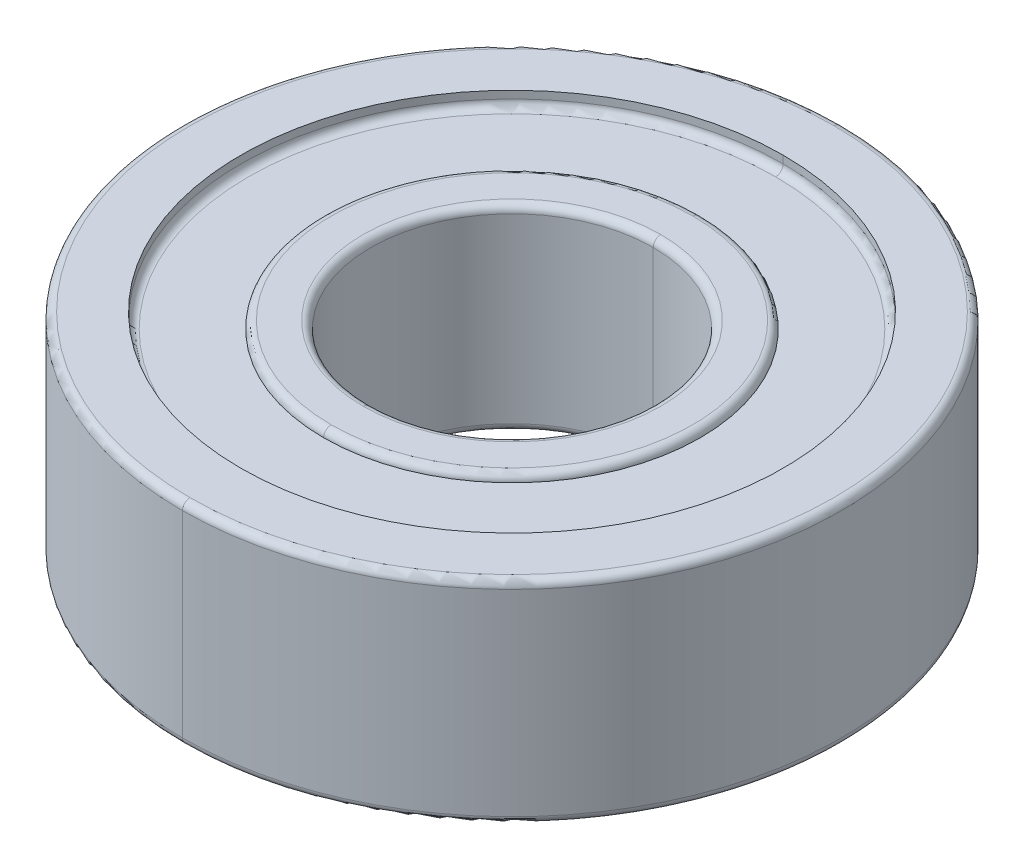
ISO-10303-21;
HEADER;
FILE_DESCRIPTION(('STEP AP214'),'2;1');
FILE_NAME('part.step','',(''),(''),'','','');
FILE_SCHEMA(('AUTOMOTIVE_DESIGN { 1 0 10303 214 1 1 1 1 }'));
ENDSEC;
DATA;
#1=APPLICATION_CONTEXT('core data for automotive mechanical design processes');
#2=APPLICATION_PROTOCOL_DEFINITION('international standard','automotive_design',2000,#1);
#3=PRODUCT_CONTEXT('',#1,'mechanical');
#4=PRODUCT('Part','Part','',(#3));
#5=PRODUCT_RELATED_PRODUCT_CATEGORY('part','',(#4));
#6=PRODUCT_DEFINITION_FORMATION('','',#4);
#7=PRODUCT_DEFINITION_CONTEXT('part definition',#1,'design');
#8=PRODUCT_DEFINITION('design','',#6,#7);
#9=PRODUCT_DEFINITION_SHAPE('','',#8);
#10=(LENGTH_UNIT() NAMED_UNIT(*) SI_UNIT(.MILLI.,.METRE.));
#11=(NAMED_UNIT(*) PLANE_ANGLE_UNIT() SI_UNIT($,.RADIAN.));
#12=(NAMED_UNIT(*) SI_UNIT($,.STERADIAN.) SOLID_ANGLE_UNIT());
#13=UNCERTAINTY_MEASURE_WITH_UNIT(LENGTH_MEASURE(1.E-05),#10,'distance_accuracy_value','');
#14=(GEOMETRIC_REPRESENTATION_CONTEXT(3) GLOBAL_UNCERTAINTY_ASSIGNED_CONTEXT((#13)) GLOBAL_UNIT_ASSIGNED_CONTEXT((#10,
#11,#12)) REPRESENTATION_CONTEXT('',''));
#15=CARTESIAN_POINT('',(0.,0.,0.));
#16=DIRECTION('',(0.,0.,1.));
#17=DIRECTION('',(1.,0.,0.));
#18=AXIS2_PLACEMENT_3D('',#15,#16,#17);
#19=CARTESIAN_POINT('',(0.,0.508,0.));
#20=DIRECTION('',(0.,-1.,0.));
#21=DIRECTION('',(0.,0.,-1.));
#22=AXIS2_PLACEMENT_3D('',#19,#20,#21);
#23=TOROIDAL_SURFACE('',#22,6.096,0.254);
#24=CARTESIAN_POINT('',(0.,0.508,6.096));
#25=DIRECTION('',(1.,0.,0.));
#26=DIRECTION('',(0.,0.,-1.));
#27=AXIS2_PLACEMENT_3D('',#24,#25,#26);
#28=CIRCLE('',#27,0.254);
#29=CARTESIAN_POINT('',(0.,0.508,6.35));
#30=VERTEX_POINT('',#29);
#31=CARTESIAN_POINT('',(0.,0.254,6.096));
#32=VERTEX_POINT('',#31);
#33=EDGE_CURVE('E318',#30,#32,#28,.T.);
#34=ORIENTED_EDGE('',*,*,#33,.F.);
#35=CARTESIAN_POINT('',(0.,0.508,0.));
#36=DIRECTION('',(0.,-1.,0.));
#37=DIRECTION('',(0.,0.,-1.));
#38=AXIS2_PLACEMENT_3D('',#35,#36,#37);
#39=CIRCLE('',#38,6.35);
#40=CARTESIAN_POINT('',(0.,0.508,-6.35));
#41=VERTEX_POINT('',#40);
#42=EDGE_CURVE('E190',#30,#41,#39,.T.);
#43=ORIENTED_EDGE('',*,*,#42,.T.);
#44=CARTESIAN_POINT('',(0.,0.508,-6.096));
#45=DIRECTION('',(-1.,0.,0.));
#46=DIRECTION('',(0.,0.,1.));
#47=AXIS2_PLACEMENT_3D('',#44,#45,#46);
#48=CIRCLE('',#47,0.254);
#49=CARTESIAN_POINT('',(0.,0.254,-6.096));
#50=VERTEX_POINT('',#49);
#51=EDGE_CURVE('E317',#41,#50,#48,.T.);
#52=ORIENTED_EDGE('',*,*,#51,.T.);
#53=CARTESIAN_POINT('',(0.,0.254,0.));
#54=DIRECTION('',(0.,-1.,0.));
#55=DIRECTION('',(0.,0.,-1.));
#56=AXIS2_PLACEMENT_3D('',#53,#54,#55);
#57=CIRCLE('',#56,6.096);
#58=EDGE_CURVE('E29',#32,#50,#57,.T.);
#59=ORIENTED_EDGE('',*,*,#58,.F.);
#60=EDGE_LOOP('',(#34,#43,#52,#59));
#61=FACE_BOUND('',#60,.T.);
#62=ADVANCED_FACE('F18',(#61),#23,.T.);
#63=CARTESIAN_POINT('',(0.,0.508,0.));
#64=DIRECTION('',(0.,-1.,0.));
#65=DIRECTION('',(0.,0.,-1.));
#66=AXIS2_PLACEMENT_3D('',#63,#64,#65);
#67=TOROIDAL_SURFACE('',#66,5.0165,0.254);
#68=CARTESIAN_POINT('',(0.,0.508,5.0165));
#69=DIRECTION('',(1.,0.,0.));
#70=DIRECTION('',(0.,0.,-1.));
#71=AXIS2_PLACEMENT_3D('',#68,#69,#70);
#72=CIRCLE('',#71,0.254);
#73=CARTESIAN_POINT('',(0.,0.254,5.0165));
#74=VERTEX_POINT('',#73);
#75=CARTESIAN_POINT('',(0.,0.508,4.7625));
#76=VERTEX_POINT('',#75);
#77=EDGE_CURVE('E228',#74,#76,#72,.T.);
#78=ORIENTED_EDGE('',*,*,#77,.F.);
#79=CARTESIAN_POINT('',(0.,0.254,0.));
#80=DIRECTION('',(0.,1.,0.));
#81=DIRECTION('',(0.,0.,-1.));
#82=AXIS2_PLACEMENT_3D('',#79,#80,#81);
#83=CIRCLE('',#82,5.0165);
#84=CARTESIAN_POINT('',(0.,0.254,-5.0165));
#85=VERTEX_POINT('',#84);
#86=EDGE_CURVE('E11',#85,#74,#83,.T.);
#87=ORIENTED_EDGE('',*,*,#86,.F.);
#88=CARTESIAN_POINT('',(0.,0.508,-5.0165));
#89=DIRECTION('',(-1.,0.,0.));
#90=DIRECTION('',(0.,0.,1.));
#91=AXIS2_PLACEMENT_3D('',#88,#89,#90);
#92=CIRCLE('',#91,0.254);
#93=CARTESIAN_POINT('',(0.,0.508,-4.7625));
#94=VERTEX_POINT('',#93);
#95=EDGE_CURVE('E215',#85,#94,#92,.T.);
#96=ORIENTED_EDGE('',*,*,#95,.T.);
#97=CARTESIAN_POINT('',(0.,0.508,0.));
#98=DIRECTION('',(0.,-1.,0.));
#99=DIRECTION('',(0.,0.,-1.));
#100=AXIS2_PLACEMENT_3D('',#97,#98,#99);
#101=CIRCLE('',#100,4.7625);
#102=EDGE_CURVE('E372',#76,#94,#101,.T.);
#103=ORIENTED_EDGE('',*,*,#102,.F.);
#104=EDGE_LOOP('',(#78,#87,#96,#103));
#105=FACE_BOUND('',#104,.T.);
#106=ADVANCED_FACE('F470',(#105),#67,.T.);
#107=CARTESIAN_POINT('',(0.,0.254,0.));
#108=DIRECTION('',(0.,-1.,0.));
#109=DIRECTION('',(0.,0.,-1.));
#110=AXIS2_PLACEMENT_3D('',#107,#108,#109);
#111=TOROIDAL_SURFACE('',#110,8.89,0.254);
#112=CARTESIAN_POINT('',(0.,0.254,8.89));
#113=DIRECTION('',(1.,0.,0.));
#114=DIRECTION('',(0.,0.,-1.));
#115=AXIS2_PLACEMENT_3D('',#112,#113,#114);
#116=CIRCLE('',#115,0.254);
#117=CARTESIAN_POINT('',(0.,0.508,8.89));
#118=VERTEX_POINT('',#117);
#119=CARTESIAN_POINT('',(0.,0.254,9.144));
#120=VERTEX_POINT('',#119);
#121=EDGE_CURVE('E181',#118,#120,#116,.T.);
#122=ORIENTED_EDGE('',*,*,#121,.F.);
#123=CARTESIAN_POINT('',(0.,0.508,0.));
#124=DIRECTION('',(0.,-1.,0.));
#125=DIRECTION('',(0.,0.,-1.));
#126=AXIS2_PLACEMENT_3D('',#123,#124,#125);
#127=CIRCLE('',#126,8.89);
#128=CARTESIAN_POINT('',(0.,0.508,-8.89));
#129=VERTEX_POINT('',#128);
#130=EDGE_CURVE('E260',#129,#118,#127,.T.);
#131=ORIENTED_EDGE('',*,*,#130,.F.);
#132=CARTESIAN_POINT('',(0.,0.254,-8.89));
#133=DIRECTION('',(-1.,0.,0.));
#134=DIRECTION('',(0.,0.,1.));
#135=AXIS2_PLACEMENT_3D('',#132,#133,#134);
#136=CIRCLE('',#135,0.254);
#137=CARTESIAN_POINT('',(0.,0.254,-9.144));
#138=VERTEX_POINT('',#137);
#139=EDGE_CURVE('E184',#129,#138,#136,.T.);
#140=ORIENTED_EDGE('',*,*,#139,.T.);
#141=CARTESIAN_POINT('',(0.,0.254,0.));
#142=DIRECTION('',(0.,1.,0.));
#143=DIRECTION('',(0.,0.,-1.));
#144=AXIS2_PLACEMENT_3D('',#141,#142,#143);
#145=CIRCLE('',#144,9.144);
#146=EDGE_CURVE('E177',#120,#138,#145,.T.);
#147=ORIENTED_EDGE('',*,*,#146,.F.);
#148=EDGE_LOOP('',(#122,#131,#140,#147));
#149=FACE_BOUND('',#148,.T.);
#150=ADVANCED_FACE('F179',(#149),#111,.F.);
#151=CARTESIAN_POINT('',(0.,0.254,0.));
#152=DIRECTION('',(0.,-1.,0.));
#153=DIRECTION('',(0.,0.,-1.));
#154=AXIS2_PLACEMENT_3D('',#151,#152,#153);
#155=PLANE('',#154);
#156=ORIENTED_EDGE('',*,*,#86,.T.);
#157=CARTESIAN_POINT('',(0.,0.254,0.));
#158=DIRECTION('',(0.,1.,0.));
#159=DIRECTION('',(0.,0.,-1.));
#160=AXIS2_PLACEMENT_3D('',#157,#158,#159);
#161=CIRCLE('',#160,5.0165);
#162=EDGE_CURVE('E313',#74,#85,#161,.T.);
#163=ORIENTED_EDGE('',*,*,#162,.T.);
#164=EDGE_LOOP('',(#156,#163));
#165=FACE_BOUND('',#164,.T.);
#166=CARTESIAN_POINT('',(0.,0.254,0.));
#167=DIRECTION('',(0.,-1.,0.));
#168=DIRECTION('',(0.,0.,-1.));
#169=AXIS2_PLACEMENT_3D('',#166,#167,#168);
#170=CIRCLE('',#169,6.096);
#171=EDGE_CURVE('E322',#50,#32,#170,.T.);
#172=ORIENTED_EDGE('',*,*,#171,.T.);
#173=ORIENTED_EDGE('',*,*,#58,.T.);
#174=EDGE_LOOP('',(#172,#173));
#175=FACE_BOUND('',#174,.T.);
#176=ADVANCED_FACE('F465',(#165,#175),#155,.T.);
#177=CARTESIAN_POINT('',(0.,0.508,0.));
#178=DIRECTION('',(0.,-1.,0.));
#179=DIRECTION('',(0.,0.,-1.));
#180=AXIS2_PLACEMENT_3D('',#177,#178,#179);
#181=CYLINDRICAL_SURFACE('',#180,9.144);
#182=DIRECTION('',(0.,-1.,0.));
#183=VECTOR('',#182,1.);
#184=CARTESIAN_POINT('',(0.,0.508,9.144));
#185=LINE('',#184,#183);
#186=CARTESIAN_POINT('',(0.,0.,9.144));
#187=VERTEX_POINT('',#186);
#188=EDGE_CURVE('E22',#120,#187,#185,.T.);
#189=ORIENTED_EDGE('',*,*,#188,.F.);
#190=ORIENTED_EDGE('',*,*,#146,.T.);
#191=DIRECTION('',(0.,-1.,0.));
#192=VECTOR('',#191,1.);
#193=CARTESIAN_POINT('',(0.,0.508,-9.144));
#194=LINE('',#193,#192);
#195=CARTESIAN_POINT('',(0.,0.,-9.144));
#196=VERTEX_POINT('',#195);
#197=EDGE_CURVE('E203',#138,#196,#194,.T.);
#198=ORIENTED_EDGE('',*,*,#197,.T.);
#199=CARTESIAN_POINT('',(0.,0.,0.));
#200=DIRECTION('',(0.,1.,0.));
#201=DIRECTION('',(0.,0.,1.));
#202=AXIS2_PLACEMENT_3D('',#199,#200,#201);
#203=CIRCLE('',#202,9.144);
#204=EDGE_CURVE('E195',#187,#196,#203,.T.);
#205=ORIENTED_EDGE('',*,*,#204,.F.);
#206=EDGE_LOOP('',(#189,#190,#198,#205));
#207=FACE_BOUND('',#206,.T.);
#208=ADVANCED_FACE('F194',(#207),#181,.F.);
#209=CARTESIAN_POINT('',(0.,0.508,0.));
#210=DIRECTION('',(0.,-1.,0.));
#211=DIRECTION('',(0.,0.,-1.));
#212=AXIS2_PLACEMENT_3D('',#209,#210,#211);
#213=PLANE('',#212);
#214=CARTESIAN_POINT('',(0.,0.508,0.));
#215=DIRECTION('',(0.,-1.,0.));
#216=DIRECTION('',(0.,0.,-1.));
#217=AXIS2_PLACEMENT_3D('',#214,#215,#216);
#218=CIRCLE('',#217,6.35);
#219=EDGE_CURVE('E323',#41,#30,#218,.T.);
#220=ORIENTED_EDGE('',*,*,#219,.F.);
#221=ORIENTED_EDGE('',*,*,#42,.F.);
#222=EDGE_LOOP('',(#220,#221));
#223=FACE_BOUND('',#222,.T.);
#224=ORIENTED_EDGE('',*,*,#130,.T.);
#225=CARTESIAN_POINT('',(0.,0.508,0.));
#226=DIRECTION('',(0.,-1.,0.));
#227=DIRECTION('',(0.,0.,-1.));
#228=AXIS2_PLACEMENT_3D('',#225,#226,#227);
#229=CIRCLE('',#228,8.89);
#230=EDGE_CURVE('E209',#118,#129,#229,.T.);
#231=ORIENTED_EDGE('',*,*,#230,.T.);
#232=EDGE_LOOP('',(#224,#231));
#233=FACE_BOUND('',#232,.T.);
#234=ADVANCED_FACE('F531',(#223,#233),#213,.T.);
#235=CARTESIAN_POINT('',(0.,6.63575,0.));
#236=DIRECTION('',(0.,1.,0.));
#237=DIRECTION('',(0.,0.,1.));
#238=AXIS2_PLACEMENT_3D('',#235,#236,#237);
#239=TOROIDAL_SURFACE('',#238,6.096,0.254);
#240=CARTESIAN_POINT('',(0.,6.63575,-6.096));
#241=DIRECTION('',(1.,0.,0.));
#242=DIRECTION('',(0.,0.,-1.));
#243=AXIS2_PLACEMENT_3D('',#240,#241,#242);
#244=CIRCLE('',#243,0.254);
#245=CARTESIAN_POINT('',(0.,6.63575,-6.35));
#246=VERTEX_POINT('',#245);
#247=CARTESIAN_POINT('',(0.,6.88975,-6.096));
#248=VERTEX_POINT('',#247);
#249=EDGE_CURVE('E237',#246,#248,#244,.T.);
#250=ORIENTED_EDGE('',*,*,#249,.F.);
#251=CARTESIAN_POINT('',(0.,6.63575,0.));
#252=DIRECTION('',(0.,1.,0.));
#253=DIRECTION('',(0.,0.,1.));
#254=AXIS2_PLACEMENT_3D('',#251,#252,#253);
#255=CIRCLE('',#254,6.35);
#256=CARTESIAN_POINT('',(0.,6.63575,6.35));
#257=VERTEX_POINT('',#256);
#258=EDGE_CURVE('E290',#246,#257,#255,.T.);
#259=ORIENTED_EDGE('',*,*,#258,.T.);
#260=CARTESIAN_POINT('',(0.,6.63575,6.096));
#261=DIRECTION('',(-1.,0.,0.));
#262=DIRECTION('',(0.,0.,1.));
#263=AXIS2_PLACEMENT_3D('',#260,#261,#262);
#264=CIRCLE('',#263,0.254);
#265=CARTESIAN_POINT('',(0.,6.88975,6.096));
#266=VERTEX_POINT('',#265);
#267=EDGE_CURVE('E243',#257,#266,#264,.T.);
#268=ORIENTED_EDGE('',*,*,#267,.T.);
#269=CARTESIAN_POINT('',(0.,6.88975,0.));
#270=DIRECTION('',(0.,1.,0.));
#271=DIRECTION('',(0.,0.,1.));
#272=AXIS2_PLACEMENT_3D('',#269,#270,#271);
#273=CIRCLE('',#272,6.096);
#274=EDGE_CURVE('E301',#248,#266,#273,.T.);
#275=ORIENTED_EDGE('',*,*,#274,.F.);
#276=EDGE_LOOP('',(#250,#259,#268,#275));
#277=FACE_BOUND('',#276,.T.);
#278=ADVANCED_FACE('F438',(#277),#239,.T.);
#279=CARTESIAN_POINT('',(0.,6.63575,0.));
#280=DIRECTION('',(0.,1.,0.));
#281=DIRECTION('',(0.,0.,1.));
#282=AXIS2_PLACEMENT_3D('',#279,#280,#281);
#283=TOROIDAL_SURFACE('',#282,5.0165,0.254);
#284=CARTESIAN_POINT('',(0.,6.63575,-5.0165));
#285=DIRECTION('',(1.,0.,0.));
#286=DIRECTION('',(0.,0.,-1.));
#287=AXIS2_PLACEMENT_3D('',#284,#285,#286);
#288=CIRCLE('',#287,0.254);
#289=CARTESIAN_POINT('',(0.,6.88975,-5.0165));
#290=VERTEX_POINT('',#289);
#291=CARTESIAN_POINT('',(0.,6.63575,-4.7625));
#292=VERTEX_POINT('',#291);
#293=EDGE_CURVE('E271',#290,#292,#288,.T.);
#294=ORIENTED_EDGE('',*,*,#293,.F.);
#295=CARTESIAN_POINT('',(0.,6.88975,0.));
#296=DIRECTION('',(0.,-1.,0.));
#297=DIRECTION('',(0.,0.,1.));
#298=AXIS2_PLACEMENT_3D('',#295,#296,#297);
#299=CIRCLE('',#298,5.0165);
#300=CARTESIAN_POINT('',(0.,6.88975,5.0165));
#301=VERTEX_POINT('',#300);
#302=EDGE_CURVE('E263',#301,#290,#299,.T.);
#303=ORIENTED_EDGE('',*,*,#302,.F.);
#304=CARTESIAN_POINT('',(0.,6.63575,5.0165));
#305=DIRECTION('',(-1.,0.,0.));
#306=DIRECTION('',(0.,0.,1.));
#307=AXIS2_PLACEMENT_3D('',#304,#305,#306);
#308=CIRCLE('',#307,0.254);
#309=CARTESIAN_POINT('',(0.,6.63575,4.7625));
#310=VERTEX_POINT('',#309);
#311=EDGE_CURVE('E248',#301,#310,#308,.T.);
#312=ORIENTED_EDGE('',*,*,#311,.T.);
#313=CARTESIAN_POINT('',(0.,6.63575,0.));
#314=DIRECTION('',(0.,1.,0.));
#315=DIRECTION('',(0.,0.,1.));
#316=AXIS2_PLACEMENT_3D('',#313,#314,#315);
#317=CIRCLE('',#316,4.7625);
#318=EDGE_CURVE('E277',#292,#310,#317,.T.);
#319=ORIENTED_EDGE('',*,*,#318,.F.);
#320=EDGE_LOOP('',(#294,#303,#312,#319));
#321=FACE_BOUND('',#320,.T.);
#322=ADVANCED_FACE('F482',(#321),#283,.T.);
#323=CARTESIAN_POINT('',(0.,6.88975,0.));
#324=DIRECTION('',(0.,1.,0.));
#325=DIRECTION('',(0.,0.,1.));
#326=AXIS2_PLACEMENT_3D('',#323,#324,#325);
#327=TOROIDAL_SURFACE('',#326,8.89,0.254);
#328=CARTESIAN_POINT('',(0.,6.88975,-8.89));
#329=DIRECTION('',(1.,0.,0.));
#330=DIRECTION('',(0.,0.,-1.));
#331=AXIS2_PLACEMENT_3D('',#328,#329,#330);
#332=CIRCLE('',#331,0.254);
#333=CARTESIAN_POINT('',(0.,6.63575,-8.89));
#334=VERTEX_POINT('',#333);
#335=CARTESIAN_POINT('',(0.,6.88975,-9.144));
#336=VERTEX_POINT('',#335);
#337=EDGE_CURVE('E286',#334,#336,#332,.T.);
#338=ORIENTED_EDGE('',*,*,#337,.F.);
#339=CARTESIAN_POINT('',(0.,6.63575,0.));
#340=DIRECTION('',(0.,1.,0.));
#341=DIRECTION('',(0.,0.,1.));
#342=AXIS2_PLACEMENT_3D('',#339,#340,#341);
#343=CIRCLE('',#342,8.89);
#344=CARTESIAN_POINT('',(0.,6.63575,8.89));
#345=VERTEX_POINT('',#344);
#346=EDGE_CURVE('E294',#345,#334,#343,.T.);
#347=ORIENTED_EDGE('',*,*,#346,.F.);
#348=CARTESIAN_POINT('',(0.,6.88975,8.89));
#349=DIRECTION('',(-1.,0.,0.));
#350=DIRECTION('',(0.,0.,1.));
#351=AXIS2_PLACEMENT_3D('',#348,#349,#350);
#352=CIRCLE('',#351,0.254);
#353=CARTESIAN_POINT('',(0.,6.88975,9.144));
#354=VERTEX_POINT('',#353);
#355=EDGE_CURVE('E231',#345,#354,#352,.T.);
#356=ORIENTED_EDGE('',*,*,#355,.T.);
#357=CARTESIAN_POINT('',(0.,6.88975,0.));
#358=DIRECTION('',(0.,-1.,0.));
#359=DIRECTION('',(0.,0.,1.));
#360=AXIS2_PLACEMENT_3D('',#357,#358,#359);
#361=CIRCLE('',#360,9.144);
#362=EDGE_CURVE('E304',#336,#354,#361,.T.);
#363=ORIENTED_EDGE('',*,*,#362,.F.);
#364=EDGE_LOOP('',(#338,#347,#356,#363));
#365=FACE_BOUND('',#364,.T.);
#366=ADVANCED_FACE('F448',(#365),#327,.F.);
#367=CARTESIAN_POINT('',(0.,6.88975,0.));
#368=DIRECTION('',(0.,1.,0.));
#369=DIRECTION('',(1.,0.,0.));
#370=AXIS2_PLACEMENT_3D('',#367,#368,#369);
#371=PLANE('',#370);
#372=ORIENTED_EDGE('',*,*,#302,.T.);
#373=CARTESIAN_POINT('',(0.,6.88975,0.));
#374=DIRECTION('',(0.,-1.,0.));
#375=DIRECTION('',(0.,0.,1.));
#376=AXIS2_PLACEMENT_3D('',#373,#374,#375);
#377=CIRCLE('',#376,5.0165);
#378=EDGE_CURVE('E247',#290,#301,#377,.T.);
#379=ORIENTED_EDGE('',*,*,#378,.T.);
#380=EDGE_LOOP('',(#372,#379));
#381=FACE_BOUND('',#380,.T.);
#382=CARTESIAN_POINT('',(0.,6.88975,0.));
#383=DIRECTION('',(0.,1.,0.));
#384=DIRECTION('',(0.,0.,1.));
#385=AXIS2_PLACEMENT_3D('',#382,#383,#384);
#386=CIRCLE('',#385,6.096);
#387=EDGE_CURVE('E241',#266,#248,#386,.T.);
#388=ORIENTED_EDGE('',*,*,#387,.T.);
#389=ORIENTED_EDGE('',*,*,#274,.T.);
#390=EDGE_LOOP('',(#388,#389));
#391=FACE_BOUND('',#390,.T.);
#392=ADVANCED_FACE('F430',(#381,#391),#371,.T.);
#393=CARTESIAN_POINT('',(0.,6.63575,0.));
#394=DIRECTION('',(0.,1.,0.));
#395=DIRECTION('',(0.,0.,1.));
#396=AXIS2_PLACEMENT_3D('',#393,#394,#395);
#397=CYLINDRICAL_SURFACE('',#396,9.144);
#398=DIRECTION('',(0.,1.,0.));
#399=VECTOR('',#398,1.);
#400=CARTESIAN_POINT('',(0.,6.63575,-9.144));
#401=LINE('',#400,#399);
#402=CARTESIAN_POINT('',(0.,7.14375,-9.144));
#403=VERTEX_POINT('',#402);
#404=EDGE_CURVE('E235',#336,#403,#401,.T.);
#405=ORIENTED_EDGE('',*,*,#404,.F.);
#406=ORIENTED_EDGE('',*,*,#362,.T.);
#407=DIRECTION('',(0.,1.,0.));
#408=VECTOR('',#407,1.);
#409=CARTESIAN_POINT('',(0.,6.63575,9.144));
#410=LINE('',#409,#408);
#411=CARTESIAN_POINT('',(0.,7.14375,9.144));
#412=VERTEX_POINT('',#411);
#413=EDGE_CURVE('E300',#354,#412,#410,.T.);
#414=ORIENTED_EDGE('',*,*,#413,.T.);
#415=CARTESIAN_POINT('',(0.,7.14375,0.));
#416=DIRECTION('',(0.,1.,0.));
#417=DIRECTION('',(0.,0.,1.));
#418=AXIS2_PLACEMENT_3D('',#415,#416,#417);
#419=CIRCLE('',#418,9.144);
#420=EDGE_CURVE('E312',#412,#403,#419,.T.);
#421=ORIENTED_EDGE('',*,*,#420,.T.);
#422=EDGE_LOOP('',(#405,#406,#414,#421));
#423=FACE_BOUND('',#422,.T.);
#424=ADVANCED_FACE('F20',(#423),#397,.F.);
#425=CARTESIAN_POINT('',(0.,6.88975,0.));
#426=DIRECTION('',(0.,1.,0.));
#427=DIRECTION('',(0.,0.,1.));
#428=AXIS2_PLACEMENT_3D('',#425,#426,#427);
#429=TOROIDAL_SURFACE('',#428,10.8585,0.254);
#430=CARTESIAN_POINT('',(0.,6.88975,-10.8585));
#431=DIRECTION('',(1.,0.,0.));
#432=DIRECTION('',(0.,0.,-1.));
#433=AXIS2_PLACEMENT_3D('',#430,#431,#432);
#434=CIRCLE('',#433,0.254);
#435=CARTESIAN_POINT('',(0.,6.88975,-11.1125));
#436=VERTEX_POINT('',#435);
#437=CARTESIAN_POINT('',(0.,7.14375,-10.8585));
#438=VERTEX_POINT('',#437);
#439=EDGE_CURVE('E299',#436,#438,#434,.T.);
#440=ORIENTED_EDGE('',*,*,#439,.F.);
#441=CARTESIAN_POINT('',(0.,6.88975,0.));
#442=DIRECTION('',(0.,-1.,0.));
#443=DIRECTION('',(0.,0.,1.));
#444=AXIS2_PLACEMENT_3D('',#441,#442,#443);
#445=CIRCLE('',#444,11.1125);
#446=CARTESIAN_POINT('',(0.,6.88975,11.1125));
#447=VERTEX_POINT('',#446);
#448=EDGE_CURVE('E343',#447,#436,#445,.T.);
#449=ORIENTED_EDGE('',*,*,#448,.F.);
#450=CARTESIAN_POINT('',(0.,6.88975,10.8585));
#451=DIRECTION('',(-1.,0.,0.));
#452=DIRECTION('',(0.,0.,1.));
#453=AXIS2_PLACEMENT_3D('',#450,#451,#452);
#454=CIRCLE('',#453,0.254);
#455=CARTESIAN_POINT('',(0.,7.14375,10.8585));
#456=VERTEX_POINT('',#455);
#457=EDGE_CURVE('E309',#447,#456,#454,.T.);
#458=ORIENTED_EDGE('',*,*,#457,.T.);
#459=CARTESIAN_POINT('',(0.,7.14375,0.));
#460=DIRECTION('',(0.,1.,0.));
#461=DIRECTION('',(0.,0.,1.));
#462=AXIS2_PLACEMENT_3D('',#459,#460,#461);
#463=CIRCLE('',#462,10.8585);
#464=EDGE_CURVE('E293',#438,#456,#463,.T.);
#465=ORIENTED_EDGE('',*,*,#464,.F.);
#466=EDGE_LOOP('',(#440,#449,#458,#465));
#467=FACE_BOUND('',#466,.T.);
#468=ADVANCED_FACE('F494',(#467),#429,.T.);
#469=CARTESIAN_POINT('',(0.,0.254,0.));
#470=DIRECTION('',(0.,1.,0.));
#471=DIRECTION('',(0.,0.,1.));
#472=AXIS2_PLACEMENT_3D('',#469,#470,#471);
#473=TOROIDAL_SURFACE('',#472,10.8585,0.254);
#474=CARTESIAN_POINT('',(0.,0.254,-10.8585));
#475=DIRECTION('',(1.,0.,0.));
#476=DIRECTION('',(0.,0.,-1.));
#477=AXIS2_PLACEMENT_3D('',#474,#475,#476);
#478=CIRCLE('',#477,0.254);
#479=CARTESIAN_POINT('',(0.,0.,-10.8585));
#480=VERTEX_POINT('',#479);
#481=CARTESIAN_POINT('',(0.,0.254,-11.1125));
#482=VERTEX_POINT('',#481);
#483=EDGE_CURVE('E272',#480,#482,#478,.T.);
#484=ORIENTED_EDGE('',*,*,#483,.F.);
#485=CARTESIAN_POINT('',(0.,0.,0.));
#486=DIRECTION('',(0.,-1.,0.));
#487=DIRECTION('',(0.,0.,1.));
#488=AXIS2_PLACEMENT_3D('',#485,#486,#487);
#489=CIRCLE('',#488,10.8585);
#490=CARTESIAN_POINT('',(0.,0.,10.8585));
#491=VERTEX_POINT('',#490);
#492=EDGE_CURVE('E264',#491,#480,#489,.T.);
#493=ORIENTED_EDGE('',*,*,#492,.F.);
#494=CARTESIAN_POINT('',(0.,0.254,10.8585));
#495=DIRECTION('',(-1.,0.,0.));
#496=DIRECTION('',(0.,0.,1.));
#497=AXIS2_PLACEMENT_3D('',#494,#495,#496);
#498=CIRCLE('',#497,0.254);
#499=CARTESIAN_POINT('',(0.,0.254,11.1125));
#500=VERTEX_POINT('',#499);
#501=EDGE_CURVE('E254',#491,#500,#498,.T.);
#502=ORIENTED_EDGE('',*,*,#501,.T.);
#503=CARTESIAN_POINT('',(0.,0.254,0.));
#504=DIRECTION('',(0.,1.,0.));
#505=DIRECTION('',(0.,0.,1.));
#506=AXIS2_PLACEMENT_3D('',#503,#504,#505);
#507=CIRCLE('',#506,11.1125);
#508=EDGE_CURVE('E44',#482,#500,#507,.T.);
#509=ORIENTED_EDGE('',*,*,#508,.F.);
#510=EDGE_LOOP('',(#484,#493,#502,#509));
#511=FACE_BOUND('',#510,.T.);
#512=ADVANCED_FACE('F386',(#511),#473,.T.);
#513=CARTESIAN_POINT('',(0.,7.14375,0.));
#514=DIRECTION('',(0.,-1.,0.));
#515=DIRECTION('',(0.,0.,-1.));
#516=AXIS2_PLACEMENT_3D('',#513,#514,#515);
#517=CYLINDRICAL_SURFACE('',#516,11.1125);
#518=DIRECTION('',(0.,-1.,0.));
#519=VECTOR('',#518,1.);
#520=CARTESIAN_POINT('',(0.,7.14375,11.1125));
#521=LINE('',#520,#519);
#522=EDGE_CURVE('E258',#447,#500,#521,.T.);
#523=ORIENTED_EDGE('',*,*,#522,.F.);
#524=ORIENTED_EDGE('',*,*,#448,.T.);
#525=DIRECTION('',(0.,-1.,0.));
#526=VECTOR('',#525,1.);
#527=CARTESIAN_POINT('',(0.,7.14375,-11.1125));
#528=LINE('',#527,#526);
#529=EDGE_CURVE('E282',#436,#482,#528,.T.);
#530=ORIENTED_EDGE('',*,*,#529,.T.);
#531=ORIENTED_EDGE('',*,*,#508,.T.);
#532=EDGE_LOOP('',(#523,#524,#530,#531));
#533=FACE_BOUND('',#532,.T.);
#534=ADVANCED_FACE('F548',(#533),#517,.T.);
#535=CARTESIAN_POINT('',(0.,7.14375,0.));
#536=DIRECTION('',(0.,1.,0.));
#537=DIRECTION('',(1.,0.,0.));
#538=AXIS2_PLACEMENT_3D('',#535,#536,#537);
#539=PLANE('',#538);
#540=ORIENTED_EDGE('',*,*,#420,.F.);
#541=CARTESIAN_POINT('',(0.,7.14375,0.));
#542=DIRECTION('',(0.,1.,0.));
#543=DIRECTION('',(0.,0.,1.));
#544=AXIS2_PLACEMENT_3D('',#541,#542,#543);
#545=CIRCLE('',#544,9.144);
#546=EDGE_CURVE('E219',#403,#412,#545,.T.);
#547=ORIENTED_EDGE('',*,*,#546,.F.);
#548=EDGE_LOOP('',(#540,#547));
#549=FACE_BOUND('',#548,.T.);
#550=CARTESIAN_POINT('',(0.,7.14375,0.));
#551=DIRECTION('',(0.,1.,0.));
#552=DIRECTION('',(0.,0.,1.));
#553=AXIS2_PLACEMENT_3D('',#550,#551,#552);
#554=CIRCLE('',#553,10.8585);
#555=EDGE_CURVE('E305',#456,#438,#554,.T.);
#556=ORIENTED_EDGE('',*,*,#555,.T.);
#557=ORIENTED_EDGE('',*,*,#464,.T.);
#558=EDGE_LOOP('',(#556,#557));
#559=FACE_BOUND('',#558,.T.);
#560=ADVANCED_FACE('F442',(#549,#559),#539,.T.);
#561=CARTESIAN_POINT('',(0.,6.63575,0.));
#562=DIRECTION('',(0.,1.,0.));
#563=DIRECTION('',(1.,0.,0.));
#564=AXIS2_PLACEMENT_3D('',#561,#562,#563);
#565=PLANE('',#564);
#566=CARTESIAN_POINT('',(0.,6.63575,0.));
#567=DIRECTION('',(0.,1.,0.));
#568=DIRECTION('',(0.,0.,1.));
#569=AXIS2_PLACEMENT_3D('',#566,#567,#568);
#570=CIRCLE('',#569,6.35);
#571=EDGE_CURVE('E242',#257,#246,#570,.T.);
#572=ORIENTED_EDGE('',*,*,#571,.F.);
#573=ORIENTED_EDGE('',*,*,#258,.F.);
#574=EDGE_LOOP('',(#572,#573));
#575=FACE_BOUND('',#574,.T.);
#576=ORIENTED_EDGE('',*,*,#346,.T.);
#577=CARTESIAN_POINT('',(0.,6.63575,0.));
#578=DIRECTION('',(0.,1.,0.));
#579=DIRECTION('',(0.,0.,1.));
#580=AXIS2_PLACEMENT_3D('',#577,#578,#579);
#581=CIRCLE('',#580,8.89);
#582=EDGE_CURVE('E252',#334,#345,#581,.T.);
#583=ORIENTED_EDGE('',*,*,#582,.T.);
#584=EDGE_LOOP('',(#576,#583));
#585=FACE_BOUND('',#584,.T.);
#586=ADVANCED_FACE('F380',(#575,#585),#565,.T.);
#587=CARTESIAN_POINT('',(0.,0.,0.));
#588=DIRECTION('',(0.,1.,0.));
#589=DIRECTION('',(1.,0.,0.));
#590=AXIS2_PLACEMENT_3D('',#587,#588,#589);
#591=PLANE('',#590);
#592=CARTESIAN_POINT('',(0.,0.,0.));
#593=DIRECTION('',(0.,1.,0.));
#594=DIRECTION('',(0.,0.,1.));
#595=AXIS2_PLACEMENT_3D('',#592,#593,#594);
#596=CIRCLE('',#595,9.144);
#597=EDGE_CURVE('E200',#196,#187,#596,.T.);
#598=ORIENTED_EDGE('',*,*,#597,.T.);
#599=ORIENTED_EDGE('',*,*,#204,.T.);
#600=EDGE_LOOP('',(#598,#599));
#601=FACE_BOUND('',#600,.T.);
#602=ORIENTED_EDGE('',*,*,#492,.T.);
#603=CARTESIAN_POINT('',(0.,0.,0.));
#604=DIRECTION('',(0.,-1.,0.));
#605=DIRECTION('',(0.,0.,1.));
#606=AXIS2_PLACEMENT_3D('',#603,#604,#605);
#607=CIRCLE('',#606,10.8585);
#608=EDGE_CURVE('E276',#480,#491,#607,.T.);
#609=ORIENTED_EDGE('',*,*,#608,.T.);
#610=EDGE_LOOP('',(#602,#609));
#611=FACE_BOUND('',#610,.T.);
#612=ADVANCED_FACE('F376',(#601,#611),#591,.F.);
#613=CARTESIAN_POINT('',(0.,7.14375,0.));
#614=DIRECTION('',(0.,-1.,0.));
#615=DIRECTION('',(0.,0.,-1.));
#616=AXIS2_PLACEMENT_3D('',#613,#614,#615);
#617=CYLINDRICAL_SURFACE('',#616,4.7625);
#618=DIRECTION('',(0.,-1.,0.));
#619=VECTOR('',#618,1.);
#620=CARTESIAN_POINT('',(0.,7.14375,4.7625));
#621=LINE('',#620,#619);
#622=EDGE_CURVE('E281',#310,#76,#621,.T.);
#623=ORIENTED_EDGE('',*,*,#622,.F.);
#624=CARTESIAN_POINT('',(0.,6.63575,0.));
#625=DIRECTION('',(0.,1.,0.));
#626=DIRECTION('',(0.,0.,1.));
#627=AXIS2_PLACEMENT_3D('',#624,#625,#626);
#628=CIRCLE('',#627,4.7625);
#629=EDGE_CURVE('E253',#310,#292,#628,.T.);
#630=ORIENTED_EDGE('',*,*,#629,.T.);
#631=DIRECTION('',(0.,-1.,0.));
#632=VECTOR('',#631,1.);
#633=CARTESIAN_POINT('',(0.,7.14375,-4.7625));
#634=LINE('',#633,#632);
#635=EDGE_CURVE('E267',#292,#94,#634,.T.);
#636=ORIENTED_EDGE('',*,*,#635,.T.);
#637=CARTESIAN_POINT('',(0.,0.508,0.));
#638=DIRECTION('',(0.,-1.,0.));
#639=DIRECTION('',(0.,0.,-1.));
#640=AXIS2_PLACEMENT_3D('',#637,#638,#639);
#641=CIRCLE('',#640,4.7625);
#642=EDGE_CURVE('E224',#94,#76,#641,.T.);
#643=ORIENTED_EDGE('',*,*,#642,.T.);
#644=EDGE_LOOP('',(#623,#630,#636,#643));
#645=FACE_BOUND('',#644,.T.);
#646=ADVANCED_FACE('F379',(#645),#617,.F.);
#647=CARTESIAN_POINT('',(0.,7.14375,0.));
#648=DIRECTION('',(0.,-1.,0.));
#649=DIRECTION('',(0.,0.,-1.));
#650=AXIS2_PLACEMENT_3D('',#647,#648,#649);
#651=CYLINDRICAL_SURFACE('',#650,4.7625);
#652=ORIENTED_EDGE('',*,*,#318,.T.);
#653=ORIENTED_EDGE('',*,*,#622,.T.);
#654=ORIENTED_EDGE('',*,*,#102,.T.);
#655=ORIENTED_EDGE('',*,*,#635,.F.);
#656=EDGE_LOOP('',(#652,#653,#654,#655));
#657=FACE_BOUND('',#656,.T.);
#658=ADVANCED_FACE('F478',(#657),#651,.F.);
#659=CARTESIAN_POINT('',(0.,7.14375,0.));
#660=DIRECTION('',(0.,-1.,0.));
#661=DIRECTION('',(0.,0.,-1.));
#662=AXIS2_PLACEMENT_3D('',#659,#660,#661);
#663=CYLINDRICAL_SURFACE('',#662,11.1125);
#664=CARTESIAN_POINT('',(0.,6.88975,0.));
#665=DIRECTION('',(0.,-1.,0.));
#666=DIRECTION('',(0.,0.,1.));
#667=AXIS2_PLACEMENT_3D('',#664,#665,#666);
#668=CIRCLE('',#667,11.1125);
#669=EDGE_CURVE('E295',#436,#447,#668,.T.);
#670=ORIENTED_EDGE('',*,*,#669,.T.);
#671=ORIENTED_EDGE('',*,*,#522,.T.);
#672=CARTESIAN_POINT('',(0.,0.254,0.));
#673=DIRECTION('',(0.,1.,0.));
#674=DIRECTION('',(0.,0.,1.));
#675=AXIS2_PLACEMENT_3D('',#672,#673,#674);
#676=CIRCLE('',#675,11.1125);
#677=EDGE_CURVE('E259',#500,#482,#676,.T.);
#678=ORIENTED_EDGE('',*,*,#677,.T.);
#679=ORIENTED_EDGE('',*,*,#529,.F.);
#680=EDGE_LOOP('',(#670,#671,#678,#679));
#681=FACE_BOUND('',#680,.T.);
#682=ADVANCED_FACE('F517',(#681),#663,.T.);
#683=CARTESIAN_POINT('',(0.,0.254,0.));
#684=DIRECTION('',(0.,1.,0.));
#685=DIRECTION('',(0.,0.,1.));
#686=AXIS2_PLACEMENT_3D('',#683,#684,#685);
#687=TOROIDAL_SURFACE('',#686,10.8585,0.254);
#688=ORIENTED_EDGE('',*,*,#608,.F.);
#689=ORIENTED_EDGE('',*,*,#483,.T.);
#690=ORIENTED_EDGE('',*,*,#677,.F.);
#691=ORIENTED_EDGE('',*,*,#501,.F.);
#692=EDGE_LOOP('',(#688,#689,#690,#691));
#693=FACE_BOUND('',#692,.T.);
#694=ADVANCED_FACE('F389',(#693),#687,.T.);
#695=CARTESIAN_POINT('',(0.,6.88975,0.));
#696=DIRECTION('',(0.,1.,0.));
#697=DIRECTION('',(0.,0.,1.));
#698=AXIS2_PLACEMENT_3D('',#695,#696,#697);
#699=TOROIDAL_SURFACE('',#698,10.8585,0.254);
#700=ORIENTED_EDGE('',*,*,#669,.F.);
#701=ORIENTED_EDGE('',*,*,#439,.T.);
#702=ORIENTED_EDGE('',*,*,#555,.F.);
#703=ORIENTED_EDGE('',*,*,#457,.F.);
#704=EDGE_LOOP('',(#700,#701,#702,#703));
#705=FACE_BOUND('',#704,.T.);
#706=ADVANCED_FACE('F516',(#705),#699,.T.);
#707=CARTESIAN_POINT('',(0.,6.63575,0.));
#708=DIRECTION('',(0.,1.,0.));
#709=DIRECTION('',(0.,0.,1.));
#710=AXIS2_PLACEMENT_3D('',#707,#708,#709);
#711=CYLINDRICAL_SURFACE('',#710,9.144);
#712=CARTESIAN_POINT('',(0.,6.88975,0.));
#713=DIRECTION('',(0.,-1.,0.));
#714=DIRECTION('',(0.,0.,1.));
#715=AXIS2_PLACEMENT_3D('',#712,#713,#714);
#716=CIRCLE('',#715,9.144);
#717=EDGE_CURVE('E236',#354,#336,#716,.T.);
#718=ORIENTED_EDGE('',*,*,#717,.T.);
#719=ORIENTED_EDGE('',*,*,#404,.T.);
#720=ORIENTED_EDGE('',*,*,#546,.T.);
#721=ORIENTED_EDGE('',*,*,#413,.F.);
#722=EDGE_LOOP('',(#718,#719,#720,#721));
#723=FACE_BOUND('',#722,.T.);
#724=ADVANCED_FACE('F453',(#723),#711,.F.);
#725=CARTESIAN_POINT('',(0.,6.88975,0.));
#726=DIRECTION('',(0.,1.,0.));
#727=DIRECTION('',(0.,0.,1.));
#728=AXIS2_PLACEMENT_3D('',#725,#726,#727);
#729=TOROIDAL_SURFACE('',#728,8.89,0.254);
#730=ORIENTED_EDGE('',*,*,#582,.F.);
#731=ORIENTED_EDGE('',*,*,#337,.T.);
#732=ORIENTED_EDGE('',*,*,#717,.F.);
#733=ORIENTED_EDGE('',*,*,#355,.F.);
#734=EDGE_LOOP('',(#730,#731,#732,#733));
#735=FACE_BOUND('',#734,.T.);
#736=ADVANCED_FACE('F451',(#735),#729,.F.);
#737=CARTESIAN_POINT('',(0.,6.63575,0.));
#738=DIRECTION('',(0.,1.,0.));
#739=DIRECTION('',(0.,0.,1.));
#740=AXIS2_PLACEMENT_3D('',#737,#738,#739);
#741=TOROIDAL_SURFACE('',#740,5.0165,0.254);
#742=ORIENTED_EDGE('',*,*,#378,.F.);
#743=ORIENTED_EDGE('',*,*,#293,.T.);
#744=ORIENTED_EDGE('',*,*,#629,.F.);
#745=ORIENTED_EDGE('',*,*,#311,.F.);
#746=EDGE_LOOP('',(#742,#743,#744,#745));
#747=FACE_BOUND('',#746,.T.);
#748=ADVANCED_FACE('F485',(#747),#741,.T.);
#749=CARTESIAN_POINT('',(0.,6.63575,0.));
#750=DIRECTION('',(0.,1.,0.));
#751=DIRECTION('',(0.,0.,1.));
#752=AXIS2_PLACEMENT_3D('',#749,#750,#751);
#753=TOROIDAL_SURFACE('',#752,6.096,0.254);
#754=ORIENTED_EDGE('',*,*,#571,.T.);
#755=ORIENTED_EDGE('',*,*,#249,.T.);
#756=ORIENTED_EDGE('',*,*,#387,.F.);
#757=ORIENTED_EDGE('',*,*,#267,.F.);
#758=EDGE_LOOP('',(#754,#755,#756,#757));
#759=FACE_BOUND('',#758,.T.);
#760=ADVANCED_FACE('F435',(#759),#753,.T.);
#761=CARTESIAN_POINT('',(0.,0.508,0.));
#762=DIRECTION('',(0.,-1.,0.));
#763=DIRECTION('',(0.,0.,-1.));
#764=AXIS2_PLACEMENT_3D('',#761,#762,#763);
#765=CYLINDRICAL_SURFACE('',#764,9.144);
#766=CARTESIAN_POINT('',(0.,0.254,0.));
#767=DIRECTION('',(0.,1.,0.));
#768=DIRECTION('',(0.,0.,-1.));
#769=AXIS2_PLACEMENT_3D('',#766,#767,#768);
#770=CIRCLE('',#769,9.144);
#771=EDGE_CURVE('E201',#138,#120,#770,.T.);
#772=ORIENTED_EDGE('',*,*,#771,.T.);
#773=ORIENTED_EDGE('',*,*,#188,.T.);
#774=ORIENTED_EDGE('',*,*,#597,.F.);
#775=ORIENTED_EDGE('',*,*,#197,.F.);
#776=EDGE_LOOP('',(#772,#773,#774,#775));
#777=FACE_BOUND('',#776,.T.);
#778=ADVANCED_FACE('F202',(#777),#765,.F.);
#779=CARTESIAN_POINT('',(0.,0.254,0.));
#780=DIRECTION('',(0.,-1.,0.));
#781=DIRECTION('',(0.,0.,-1.));
#782=AXIS2_PLACEMENT_3D('',#779,#780,#781);
#783=TOROIDAL_SURFACE('',#782,8.89,0.254);
#784=ORIENTED_EDGE('',*,*,#230,.F.);
#785=ORIENTED_EDGE('',*,*,#121,.T.);
#786=ORIENTED_EDGE('',*,*,#771,.F.);
#787=ORIENTED_EDGE('',*,*,#139,.F.);
#788=EDGE_LOOP('',(#784,#785,#786,#787));
#789=FACE_BOUND('',#788,.T.);
#790=ADVANCED_FACE('F207',(#789),#783,.F.);
#791=CARTESIAN_POINT('',(0.,0.508,0.));
#792=DIRECTION('',(0.,-1.,0.));
#793=DIRECTION('',(0.,0.,-1.));
#794=AXIS2_PLACEMENT_3D('',#791,#792,#793);
#795=TOROIDAL_SURFACE('',#794,5.0165,0.254);
#796=ORIENTED_EDGE('',*,*,#162,.F.);
#797=ORIENTED_EDGE('',*,*,#77,.T.);
#798=ORIENTED_EDGE('',*,*,#642,.F.);
#799=ORIENTED_EDGE('',*,*,#95,.F.);
#800=EDGE_LOOP('',(#796,#797,#798,#799));
#801=FACE_BOUND('',#800,.T.);
#802=ADVANCED_FACE('F473',(#801),#795,.T.);
#803=CARTESIAN_POINT('',(0.,0.508,0.));
#804=DIRECTION('',(0.,-1.,0.));
#805=DIRECTION('',(0.,0.,-1.));
#806=AXIS2_PLACEMENT_3D('',#803,#804,#805);
#807=TOROIDAL_SURFACE('',#806,6.096,0.254);
#808=ORIENTED_EDGE('',*,*,#219,.T.);
#809=ORIENTED_EDGE('',*,*,#33,.T.);
#810=ORIENTED_EDGE('',*,*,#171,.F.);
#811=ORIENTED_EDGE('',*,*,#51,.F.);
#812=EDGE_LOOP('',(#808,#809,#810,#811));
#813=FACE_BOUND('',#812,.T.);
#814=ADVANCED_FACE('F554',(#813),#807,.T.);
#815=CLOSED_SHELL('',(#62,#106,#150,#176,#208,#234,#278,#322,#366,#392,#424,#468,#512,#534,#560,
#586,#612,#646,#658,#682,#694,#706,#724,#736,#748,#760,#778,#790,#802,#814));
#816=MANIFOLD_SOLID_BREP('B1',#815);
#817=ADVANCED_BREP_SHAPE_REPRESENTATION('',(#18,#816),#14);
#818=SHAPE_DEFINITION_REPRESENTATION(#9,#817);
ENDSEC;
END-ISO-10303-21;
